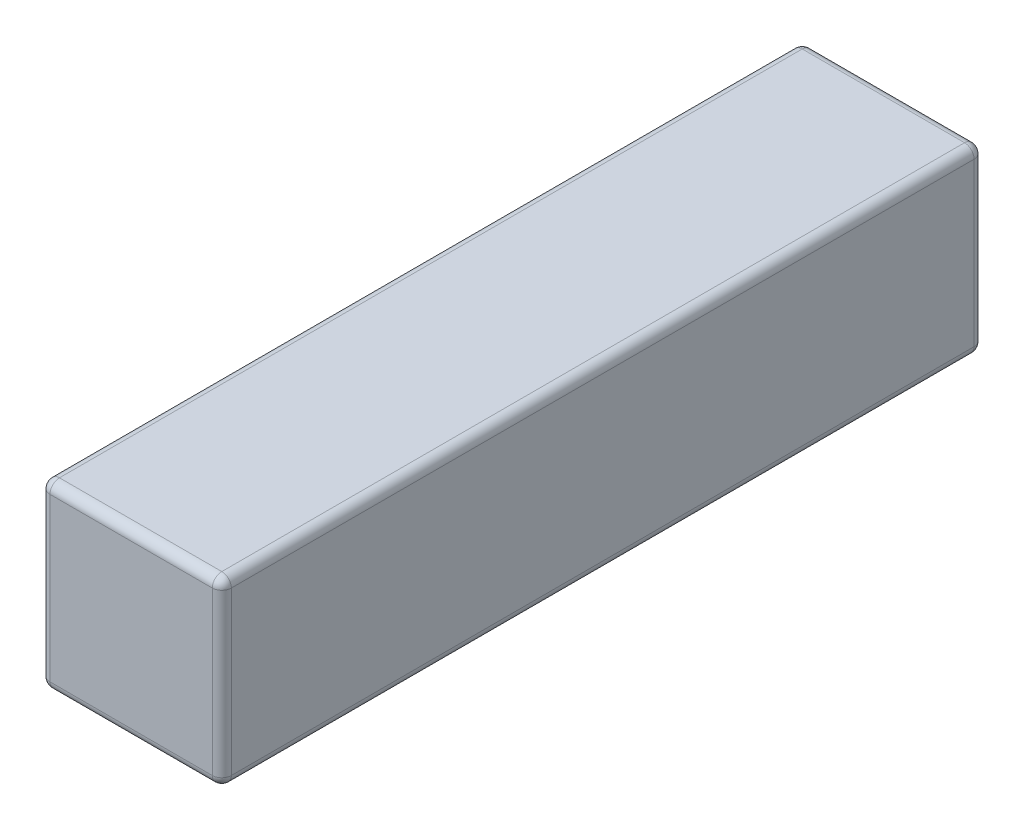
ISO-10303-21;
HEADER;
FILE_DESCRIPTION(('STEP AP214'),'2;1');
FILE_NAME('part.step','',(''),(''),'','','');
FILE_SCHEMA(('AUTOMOTIVE_DESIGN { 1 0 10303 214 1 1 1 1 }'));
ENDSEC;
DATA;
#1=APPLICATION_CONTEXT('core data for automotive mechanical design processes');
#2=APPLICATION_PROTOCOL_DEFINITION('international standard','automotive_design',2000,#1);
#3=PRODUCT_CONTEXT('',#1,'mechanical');
#4=PRODUCT('Part','Part','',(#3));
#5=PRODUCT_RELATED_PRODUCT_CATEGORY('part','',(#4));
#6=PRODUCT_DEFINITION_FORMATION('','',#4);
#7=PRODUCT_DEFINITION_CONTEXT('part definition',#1,'design');
#8=PRODUCT_DEFINITION('design','',#6,#7);
#9=PRODUCT_DEFINITION_SHAPE('','',#8);
#10=(LENGTH_UNIT() NAMED_UNIT(*) SI_UNIT(.MILLI.,.METRE.));
#11=(NAMED_UNIT(*) PLANE_ANGLE_UNIT() SI_UNIT($,.RADIAN.));
#12=(NAMED_UNIT(*) SI_UNIT($,.STERADIAN.) SOLID_ANGLE_UNIT());
#13=UNCERTAINTY_MEASURE_WITH_UNIT(LENGTH_MEASURE(1.E-05),#10,'distance_accuracy_value','');
#14=(GEOMETRIC_REPRESENTATION_CONTEXT(3) GLOBAL_UNCERTAINTY_ASSIGNED_CONTEXT((#13)) GLOBAL_UNIT_ASSIGNED_CONTEXT((#10,
#11,#12)) REPRESENTATION_CONTEXT('',''));
#15=CARTESIAN_POINT('',(0.,0.,0.));
#16=DIRECTION('',(0.,0.,1.));
#17=DIRECTION('',(1.,0.,0.));
#18=AXIS2_PLACEMENT_3D('',#15,#16,#17);
#19=CARTESIAN_POINT('',(-4.7625,-4.7625,40.));
#20=DIRECTION('',(-1.,0.,0.));
#21=DIRECTION('',(0.,0.,1.));
#22=AXIS2_PLACEMENT_3D('',#19,#20,#21);
#23=PLANE('',#22);
#24=DIRECTION('',(0.,0.,-1.));
#25=VECTOR('',#24,1.);
#26=CARTESIAN_POINT('',(-4.7625,-4.2625,40.));
#27=LINE('',#26,#25);
#28=CARTESIAN_POINT('',(-4.7625,-4.2625,0.5));
#29=VERTEX_POINT('',#28);
#30=CARTESIAN_POINT('',(-4.7625,-4.2625,39.5));
#31=VERTEX_POINT('',#30);
#32=EDGE_CURVE('E242',#29,#31,#27,.F.);
#33=ORIENTED_EDGE('',*,*,#32,.T.);
#34=DIRECTION('',(0.,1.,0.));
#35=VECTOR('',#34,1.);
#36=CARTESIAN_POINT('',(-4.7625,4.7625,39.5));
#37=LINE('',#36,#35);
#38=CARTESIAN_POINT('',(-4.7625,4.2625,39.5));
#39=VERTEX_POINT('',#38);
#40=EDGE_CURVE('E247',#31,#39,#37,.T.);
#41=ORIENTED_EDGE('',*,*,#40,.T.);
#42=DIRECTION('',(0.,0.,-1.));
#43=VECTOR('',#42,1.);
#44=CARTESIAN_POINT('',(-4.7625,4.2625,40.));
#45=LINE('',#44,#43);
#46=CARTESIAN_POINT('',(-4.7625,4.2625,0.5));
#47=VERTEX_POINT('',#46);
#48=EDGE_CURVE('E243',#39,#47,#45,.T.);
#49=ORIENTED_EDGE('',*,*,#48,.T.);
#50=DIRECTION('',(0.,1.,0.));
#51=VECTOR('',#50,1.);
#52=CARTESIAN_POINT('',(-4.7625,-4.7625,0.5));
#53=LINE('',#52,#51);
#54=EDGE_CURVE('E238',#47,#29,#53,.F.);
#55=ORIENTED_EDGE('',*,*,#54,.T.);
#56=EDGE_LOOP('',(#33,#41,#49,#55));
#57=FACE_BOUND('',#56,.T.);
#58=ADVANCED_FACE('F38',(#57),#23,.T.);
#59=CARTESIAN_POINT('',(-4.7625,-4.7625,40.));
#60=DIRECTION('',(0.,1.,0.));
#61=DIRECTION('',(0.,0.,1.));
#62=AXIS2_PLACEMENT_3D('',#59,#60,#61);
#63=PLANE('',#62);
#64=DIRECTION('',(1.,0.,0.));
#65=VECTOR('',#64,1.);
#66=CARTESIAN_POINT('',(4.7625,-4.7625,0.5));
#67=LINE('',#66,#65);
#68=CARTESIAN_POINT('',(-4.2625,-4.7625,0.5));
#69=VERTEX_POINT('',#68);
#70=CARTESIAN_POINT('',(4.2625,-4.7625,0.5));
#71=VERTEX_POINT('',#70);
#72=EDGE_CURVE('E296',#69,#71,#67,.T.);
#73=ORIENTED_EDGE('',*,*,#72,.T.);
#74=DIRECTION('',(0.,0.,-1.));
#75=VECTOR('',#74,1.);
#76=CARTESIAN_POINT('',(4.2625,-4.7625,40.));
#77=LINE('',#76,#75);
#78=CARTESIAN_POINT('',(4.2625,-4.7625,39.5));
#79=VERTEX_POINT('',#78);
#80=EDGE_CURVE('E302',#71,#79,#77,.F.);
#81=ORIENTED_EDGE('',*,*,#80,.T.);
#82=DIRECTION('',(1.,0.,0.));
#83=VECTOR('',#82,1.);
#84=CARTESIAN_POINT('',(-4.7625,-4.7625,39.5));
#85=LINE('',#84,#83);
#86=CARTESIAN_POINT('',(-4.2625,-4.7625,39.5));
#87=VERTEX_POINT('',#86);
#88=EDGE_CURVE('E299',#79,#87,#85,.F.);
#89=ORIENTED_EDGE('',*,*,#88,.T.);
#90=DIRECTION('',(0.,0.,-1.));
#91=VECTOR('',#90,1.);
#92=CARTESIAN_POINT('',(-4.2625,-4.7625,0.));
#93=LINE('',#92,#91);
#94=EDGE_CURVE('E290',#87,#69,#93,.T.);
#95=ORIENTED_EDGE('',*,*,#94,.T.);
#96=EDGE_LOOP('',(#73,#81,#89,#95));
#97=FACE_BOUND('',#96,.T.);
#98=ADVANCED_FACE('F300',(#97),#63,.F.);
#99=CARTESIAN_POINT('',(4.7625,-4.7625,40.));
#100=DIRECTION('',(-1.,0.,0.));
#101=DIRECTION('',(0.,0.,1.));
#102=AXIS2_PLACEMENT_3D('',#99,#100,#101);
#103=PLANE('',#102);
#104=DIRECTION('',(0.,1.,0.));
#105=VECTOR('',#104,1.);
#106=CARTESIAN_POINT('',(4.7625,-4.7625,39.5));
#107=LINE('',#106,#105);
#108=CARTESIAN_POINT('',(4.7625,4.2625,39.5));
#109=VERTEX_POINT('',#108);
#110=CARTESIAN_POINT('',(4.7625,-4.2625,39.5));
#111=VERTEX_POINT('',#110);
#112=EDGE_CURVE('E161',#109,#111,#107,.F.);
#113=ORIENTED_EDGE('',*,*,#112,.T.);
#114=DIRECTION('',(0.,0.,-1.));
#115=VECTOR('',#114,1.);
#116=CARTESIAN_POINT('',(4.7625,-4.2625,40.));
#117=LINE('',#116,#115);
#118=CARTESIAN_POINT('',(4.7625,-4.2625,0.5));
#119=VERTEX_POINT('',#118);
#120=EDGE_CURVE('E249',#111,#119,#117,.T.);
#121=ORIENTED_EDGE('',*,*,#120,.T.);
#122=DIRECTION('',(0.,1.,0.));
#123=VECTOR('',#122,1.);
#124=CARTESIAN_POINT('',(4.7625,4.7625,0.5));
#125=LINE('',#124,#123);
#126=CARTESIAN_POINT('',(4.7625,4.2625,0.5));
#127=VERTEX_POINT('',#126);
#128=EDGE_CURVE('E327',#119,#127,#125,.T.);
#129=ORIENTED_EDGE('',*,*,#128,.T.);
#130=DIRECTION('',(0.,0.,-1.));
#131=VECTOR('',#130,1.);
#132=CARTESIAN_POINT('',(4.7625,4.2625,40.));
#133=LINE('',#132,#131);
#134=EDGE_CURVE('E324',#127,#109,#133,.F.);
#135=ORIENTED_EDGE('',*,*,#134,.T.);
#136=EDGE_LOOP('',(#113,#121,#129,#135));
#137=FACE_BOUND('',#136,.T.);
#138=ADVANCED_FACE('F335',(#137),#103,.F.);
#139=CARTESIAN_POINT('',(-4.7625,4.7625,40.));
#140=DIRECTION('',(0.,1.,0.));
#141=DIRECTION('',(0.,0.,1.));
#142=AXIS2_PLACEMENT_3D('',#139,#140,#141);
#143=PLANE('',#142);
#144=DIRECTION('',(1.,0.,0.));
#145=VECTOR('',#144,1.);
#146=CARTESIAN_POINT('',(4.7625,4.7625,39.5));
#147=LINE('',#146,#145);
#148=CARTESIAN_POINT('',(-4.2625,4.7625,39.5));
#149=VERTEX_POINT('',#148);
#150=CARTESIAN_POINT('',(4.2625,4.7625,39.5));
#151=VERTEX_POINT('',#150);
#152=EDGE_CURVE('E48',#149,#151,#147,.T.);
#153=ORIENTED_EDGE('',*,*,#152,.T.);
#154=DIRECTION('',(0.,0.,-1.));
#155=VECTOR('',#154,1.);
#156=CARTESIAN_POINT('',(4.2625,4.7625,0.));
#157=LINE('',#156,#155);
#158=CARTESIAN_POINT('',(4.2625,4.7625,0.5));
#159=VERTEX_POINT('',#158);
#160=EDGE_CURVE('E11',#151,#159,#157,.T.);
#161=ORIENTED_EDGE('',*,*,#160,.T.);
#162=DIRECTION('',(1.,0.,0.));
#163=VECTOR('',#162,1.);
#164=CARTESIAN_POINT('',(-4.7625,4.7625,0.5));
#165=LINE('',#164,#163);
#166=CARTESIAN_POINT('',(-4.2625,4.7625,0.5));
#167=VERTEX_POINT('',#166);
#168=EDGE_CURVE('E256',#159,#167,#165,.F.);
#169=ORIENTED_EDGE('',*,*,#168,.T.);
#170=DIRECTION('',(0.,0.,-1.));
#171=VECTOR('',#170,1.);
#172=CARTESIAN_POINT('',(-4.2625,4.7625,40.));
#173=LINE('',#172,#171);
#174=EDGE_CURVE('E59',#167,#149,#173,.F.);
#175=ORIENTED_EDGE('',*,*,#174,.T.);
#176=EDGE_LOOP('',(#153,#161,#169,#175));
#177=FACE_BOUND('',#176,.T.);
#178=ADVANCED_FACE('F377',(#177),#143,.T.);
#179=CARTESIAN_POINT('',(0.,0.,40.));
#180=DIRECTION('',(0.,0.,-1.));
#181=DIRECTION('',(-1.,0.,0.));
#182=AXIS2_PLACEMENT_3D('',#179,#180,#181);
#183=PLANE('',#182);
#184=DIRECTION('',(0.,1.,0.));
#185=VECTOR('',#184,1.);
#186=CARTESIAN_POINT('',(-4.2625,-4.7625,40.));
#187=LINE('',#186,#185);
#188=CARTESIAN_POINT('',(-4.2625,4.2625,40.));
#189=VERTEX_POINT('',#188);
#190=CARTESIAN_POINT('',(-4.2625,-4.2625,40.));
#191=VERTEX_POINT('',#190);
#192=EDGE_CURVE('E138',#189,#191,#187,.F.);
#193=ORIENTED_EDGE('',*,*,#192,.T.);
#194=DIRECTION('',(1.,0.,0.));
#195=VECTOR('',#194,1.);
#196=CARTESIAN_POINT('',(0.,-4.2625,40.));
#197=LINE('',#196,#195);
#198=CARTESIAN_POINT('',(4.2625,-4.2625,40.));
#199=VERTEX_POINT('',#198);
#200=EDGE_CURVE('E133',#191,#199,#197,.T.);
#201=ORIENTED_EDGE('',*,*,#200,.T.);
#202=DIRECTION('',(0.,1.,0.));
#203=VECTOR('',#202,1.);
#204=CARTESIAN_POINT('',(4.2625,0.,40.));
#205=LINE('',#204,#203);
#206=CARTESIAN_POINT('',(4.2625,4.2625,40.));
#207=VERTEX_POINT('',#206);
#208=EDGE_CURVE('E127',#199,#207,#205,.T.);
#209=ORIENTED_EDGE('',*,*,#208,.T.);
#210=DIRECTION('',(1.,0.,0.));
#211=VECTOR('',#210,1.);
#212=CARTESIAN_POINT('',(-4.7625,4.2625,40.));
#213=LINE('',#212,#211);
#214=EDGE_CURVE('E130',#207,#189,#213,.F.);
#215=ORIENTED_EDGE('',*,*,#214,.T.);
#216=EDGE_LOOP('',(#193,#201,#209,#215));
#217=FACE_BOUND('',#216,.T.);
#218=ADVANCED_FACE('F129',(#217),#183,.F.);
#219=CARTESIAN_POINT('',(0.,0.,0.));
#220=DIRECTION('',(0.,0.,-1.));
#221=DIRECTION('',(-1.,0.,0.));
#222=AXIS2_PLACEMENT_3D('',#219,#220,#221);
#223=PLANE('',#222);
#224=DIRECTION('',(0.,1.,0.));
#225=VECTOR('',#224,1.);
#226=CARTESIAN_POINT('',(4.2625,-4.7625,0.));
#227=LINE('',#226,#225);
#228=CARTESIAN_POINT('',(4.2625,4.2625,0.));
#229=VERTEX_POINT('',#228);
#230=CARTESIAN_POINT('',(4.2625,-4.2625,0.));
#231=VERTEX_POINT('',#230);
#232=EDGE_CURVE('E318',#229,#231,#227,.F.);
#233=ORIENTED_EDGE('',*,*,#232,.T.);
#234=DIRECTION('',(1.,0.,0.));
#235=VECTOR('',#234,1.);
#236=CARTESIAN_POINT('',(-4.7625,-4.2625,0.));
#237=LINE('',#236,#235);
#238=CARTESIAN_POINT('',(-4.2625,-4.2625,0.));
#239=VERTEX_POINT('',#238);
#240=EDGE_CURVE('E321',#231,#239,#237,.F.);
#241=ORIENTED_EDGE('',*,*,#240,.T.);
#242=DIRECTION('',(0.,1.,0.));
#243=VECTOR('',#242,1.);
#244=CARTESIAN_POINT('',(-4.2625,0.,0.));
#245=LINE('',#244,#243);
#246=CARTESIAN_POINT('',(-4.2625,4.2625,0.));
#247=VERTEX_POINT('',#246);
#248=EDGE_CURVE('E236',#239,#247,#245,.T.);
#249=ORIENTED_EDGE('',*,*,#248,.T.);
#250=DIRECTION('',(1.,0.,0.));
#251=VECTOR('',#250,1.);
#252=CARTESIAN_POINT('',(0.,4.2625,0.));
#253=LINE('',#252,#251);
#254=EDGE_CURVE('E310',#247,#229,#253,.T.);
#255=ORIENTED_EDGE('',*,*,#254,.T.);
#256=EDGE_LOOP('',(#233,#241,#249,#255));
#257=FACE_BOUND('',#256,.T.);
#258=ADVANCED_FACE('F410',(#257),#223,.T.);
#259=CARTESIAN_POINT('',(0.,4.2625,0.5));
#260=DIRECTION('',(1.,0.,0.));
#261=DIRECTION('',(0.,0.,-1.));
#262=AXIS2_PLACEMENT_3D('',#259,#260,#261);
#263=CYLINDRICAL_SURFACE('',#262,0.5);
#264=CARTESIAN_POINT('',(-4.2625,4.2625,0.5));
#265=DIRECTION('',(-1.,0.,0.));
#266=DIRECTION('',(0.,0.,1.));
#267=AXIS2_PLACEMENT_3D('',#264,#265,#266);
#268=CIRCLE('',#267,0.5);
#269=EDGE_CURVE('E42',#167,#247,#268,.T.);
#270=ORIENTED_EDGE('',*,*,#269,.F.);
#271=ORIENTED_EDGE('',*,*,#168,.F.);
#272=CARTESIAN_POINT('',(4.2625,4.2625,0.5));
#273=DIRECTION('',(1.,0.,0.));
#274=DIRECTION('',(0.,0.,-1.));
#275=AXIS2_PLACEMENT_3D('',#272,#273,#274);
#276=CIRCLE('',#275,0.5);
#277=EDGE_CURVE('E214',#229,#159,#276,.T.);
#278=ORIENTED_EDGE('',*,*,#277,.F.);
#279=ORIENTED_EDGE('',*,*,#254,.F.);
#280=EDGE_LOOP('',(#270,#271,#278,#279));
#281=FACE_BOUND('',#280,.T.);
#282=ADVANCED_FACE('F40',(#281),#263,.T.);
#283=CARTESIAN_POINT('',(-4.2625,4.2625,0.5));
#284=DIRECTION('',(0.,0.,-1.));
#285=DIRECTION('',(-1.,0.,0.));
#286=AXIS2_PLACEMENT_3D('',#283,#284,#285);
#287=SPHERICAL_SURFACE('',#286,0.5);
#288=CARTESIAN_POINT('',(-4.2625,4.2625,0.5));
#289=DIRECTION('',(0.,0.,-1.));
#290=DIRECTION('',(-1.,0.,0.));
#291=AXIS2_PLACEMENT_3D('',#288,#289,#290);
#292=CIRCLE('',#291,0.5);
#293=EDGE_CURVE('E207',#167,#47,#292,.F.);
#294=ORIENTED_EDGE('',*,*,#293,.F.);
#295=ORIENTED_EDGE('',*,*,#269,.T.);
#296=CARTESIAN_POINT('',(-4.2625,4.2625,0.5));
#297=DIRECTION('',(0.,1.,0.));
#298=DIRECTION('',(0.,0.,1.));
#299=AXIS2_PLACEMENT_3D('',#296,#297,#298);
#300=CIRCLE('',#299,0.5);
#301=EDGE_CURVE('E211',#47,#247,#300,.F.);
#302=ORIENTED_EDGE('',*,*,#301,.F.);
#303=EDGE_LOOP('',(#294,#295,#302));
#304=FACE_BOUND('',#303,.T.);
#305=ADVANCED_FACE('F228',(#304),#287,.T.);
#306=CARTESIAN_POINT('',(4.2625,4.2625,0.5));
#307=DIRECTION('',(0.,1.,0.));
#308=DIRECTION('',(0.,0.,1.));
#309=AXIS2_PLACEMENT_3D('',#306,#307,#308);
#310=SPHERICAL_SURFACE('',#309,0.5);
#311=CARTESIAN_POINT('',(4.2625,4.2625,0.5));
#312=DIRECTION('',(0.,1.,0.));
#313=DIRECTION('',(0.,0.,1.));
#314=AXIS2_PLACEMENT_3D('',#311,#312,#313);
#315=CIRCLE('',#314,0.5);
#316=EDGE_CURVE('E200',#229,#127,#315,.F.);
#317=ORIENTED_EDGE('',*,*,#316,.F.);
#318=ORIENTED_EDGE('',*,*,#277,.T.);
#319=CARTESIAN_POINT('',(4.2625,4.2625,0.5));
#320=DIRECTION('',(0.,0.,-1.));
#321=DIRECTION('',(-1.,0.,0.));
#322=AXIS2_PLACEMENT_3D('',#319,#320,#321);
#323=CIRCLE('',#322,0.5);
#324=EDGE_CURVE('E204',#127,#159,#323,.F.);
#325=ORIENTED_EDGE('',*,*,#324,.F.);
#326=EDGE_LOOP('',(#317,#318,#325));
#327=FACE_BOUND('',#326,.T.);
#328=ADVANCED_FACE('F407',(#327),#310,.T.);
#329=CARTESIAN_POINT('',(-4.2625,0.,0.5));
#330=DIRECTION('',(0.,1.,0.));
#331=DIRECTION('',(0.,0.,1.));
#332=AXIS2_PLACEMENT_3D('',#329,#330,#331);
#333=CYLINDRICAL_SURFACE('',#332,0.5);
#334=ORIENTED_EDGE('',*,*,#301,.T.);
#335=ORIENTED_EDGE('',*,*,#248,.F.);
#336=CARTESIAN_POINT('',(-4.2625,-4.2625,0.5));
#337=DIRECTION('',(0.,-1.,0.));
#338=DIRECTION('',(0.,0.,-1.));
#339=AXIS2_PLACEMENT_3D('',#336,#337,#338);
#340=CIRCLE('',#339,0.5);
#341=EDGE_CURVE('E193',#29,#239,#340,.T.);
#342=ORIENTED_EDGE('',*,*,#341,.F.);
#343=ORIENTED_EDGE('',*,*,#54,.F.);
#344=EDGE_LOOP('',(#334,#335,#342,#343));
#345=FACE_BOUND('',#344,.T.);
#346=ADVANCED_FACE('F234',(#345),#333,.T.);
#347=CARTESIAN_POINT('',(-4.2625,4.2625,40.));
#348=DIRECTION('',(0.,0.,-1.));
#349=DIRECTION('',(-1.,0.,0.));
#350=AXIS2_PLACEMENT_3D('',#347,#348,#349);
#351=CYLINDRICAL_SURFACE('',#350,0.5);
#352=ORIENTED_EDGE('',*,*,#293,.T.);
#353=ORIENTED_EDGE('',*,*,#48,.F.);
#354=CARTESIAN_POINT('',(-4.2625,4.2625,39.5));
#355=DIRECTION('',(0.,0.,1.));
#356=DIRECTION('',(1.,0.,0.));
#357=AXIS2_PLACEMENT_3D('',#354,#355,#356);
#358=CIRCLE('',#357,0.5);
#359=EDGE_CURVE('E189',#149,#39,#358,.T.);
#360=ORIENTED_EDGE('',*,*,#359,.F.);
#361=ORIENTED_EDGE('',*,*,#174,.F.);
#362=EDGE_LOOP('',(#352,#353,#360,#361));
#363=FACE_BOUND('',#362,.T.);
#364=ADVANCED_FACE('F354',(#363),#351,.T.);
#365=CARTESIAN_POINT('',(-4.7625,4.2625,39.5));
#366=DIRECTION('',(-1.,0.,0.));
#367=DIRECTION('',(0.,0.,1.));
#368=AXIS2_PLACEMENT_3D('',#365,#366,#367);
#369=CYLINDRICAL_SURFACE('',#368,0.5);
#370=CARTESIAN_POINT('',(4.2625,4.2625,39.5));
#371=DIRECTION('',(1.,0.,0.));
#372=DIRECTION('',(0.,0.,-1.));
#373=AXIS2_PLACEMENT_3D('',#370,#371,#372);
#374=CIRCLE('',#373,0.5);
#375=EDGE_CURVE('E144',#151,#207,#374,.T.);
#376=ORIENTED_EDGE('',*,*,#375,.F.);
#377=ORIENTED_EDGE('',*,*,#152,.F.);
#378=CARTESIAN_POINT('',(-4.2625,4.2625,39.5));
#379=DIRECTION('',(-1.,0.,0.));
#380=DIRECTION('',(0.,0.,1.));
#381=AXIS2_PLACEMENT_3D('',#378,#379,#380);
#382=CIRCLE('',#381,0.5);
#383=EDGE_CURVE('E147',#189,#149,#382,.T.);
#384=ORIENTED_EDGE('',*,*,#383,.F.);
#385=ORIENTED_EDGE('',*,*,#214,.F.);
#386=EDGE_LOOP('',(#376,#377,#384,#385));
#387=FACE_BOUND('',#386,.T.);
#388=ADVANCED_FACE('F143',(#387),#369,.T.);
#389=CARTESIAN_POINT('',(4.2625,4.2625,40.));
#390=DIRECTION('',(0.,0.,1.));
#391=DIRECTION('',(1.,0.,0.));
#392=AXIS2_PLACEMENT_3D('',#389,#390,#391);
#393=CYLINDRICAL_SURFACE('',#392,0.5);
#394=ORIENTED_EDGE('',*,*,#324,.T.);
#395=ORIENTED_EDGE('',*,*,#160,.F.);
#396=CARTESIAN_POINT('',(4.2625,4.2625,39.5));
#397=DIRECTION('',(0.,0.,1.));
#398=DIRECTION('',(1.,0.,0.));
#399=AXIS2_PLACEMENT_3D('',#396,#397,#398);
#400=CIRCLE('',#399,0.5);
#401=EDGE_CURVE('E157',#109,#151,#400,.T.);
#402=ORIENTED_EDGE('',*,*,#401,.F.);
#403=ORIENTED_EDGE('',*,*,#134,.F.);
#404=EDGE_LOOP('',(#394,#395,#402,#403));
#405=FACE_BOUND('',#404,.T.);
#406=ADVANCED_FACE('F409',(#405),#393,.T.);
#407=CARTESIAN_POINT('',(4.2625,-4.7625,0.5));
#408=DIRECTION('',(0.,-1.,0.));
#409=DIRECTION('',(0.,0.,-1.));
#410=AXIS2_PLACEMENT_3D('',#407,#408,#409);
#411=CYLINDRICAL_SURFACE('',#410,0.5);
#412=ORIENTED_EDGE('',*,*,#316,.T.);
#413=ORIENTED_EDGE('',*,*,#128,.F.);
#414=CARTESIAN_POINT('',(4.2625,-4.2625,0.5));
#415=DIRECTION('',(0.,-1.,0.));
#416=DIRECTION('',(0.,0.,-1.));
#417=AXIS2_PLACEMENT_3D('',#414,#415,#416);
#418=CIRCLE('',#417,0.5);
#419=EDGE_CURVE('E181',#231,#119,#418,.T.);
#420=ORIENTED_EDGE('',*,*,#419,.F.);
#421=ORIENTED_EDGE('',*,*,#232,.F.);
#422=EDGE_LOOP('',(#412,#413,#420,#421));
#423=FACE_BOUND('',#422,.T.);
#424=ADVANCED_FACE('F405',(#423),#411,.T.);
#425=CARTESIAN_POINT('',(-4.7625,-4.2625,0.5));
#426=DIRECTION('',(-1.,0.,0.));
#427=DIRECTION('',(0.,0.,1.));
#428=AXIS2_PLACEMENT_3D('',#425,#426,#427);
#429=CYLINDRICAL_SURFACE('',#428,0.5);
#430=CARTESIAN_POINT('',(-4.2625,-4.2625,0.5));
#431=DIRECTION('',(-1.,0.,0.));
#432=DIRECTION('',(0.,0.,1.));
#433=AXIS2_PLACEMENT_3D('',#430,#431,#432);
#434=CIRCLE('',#433,0.5);
#435=EDGE_CURVE('E196',#239,#69,#434,.T.);
#436=ORIENTED_EDGE('',*,*,#435,.F.);
#437=ORIENTED_EDGE('',*,*,#240,.F.);
#438=CARTESIAN_POINT('',(4.2625,-4.2625,0.5));
#439=DIRECTION('',(1.,0.,0.));
#440=DIRECTION('',(0.,0.,-1.));
#441=AXIS2_PLACEMENT_3D('',#438,#439,#440);
#442=CIRCLE('',#441,0.5);
#443=EDGE_CURVE('E177',#71,#231,#442,.T.);
#444=ORIENTED_EDGE('',*,*,#443,.F.);
#445=ORIENTED_EDGE('',*,*,#72,.F.);
#446=EDGE_LOOP('',(#436,#437,#444,#445));
#447=FACE_BOUND('',#446,.T.);
#448=ADVANCED_FACE('F366',(#447),#429,.T.);
#449=CARTESIAN_POINT('',(-4.2625,-4.2625,0.5));
#450=DIRECTION('',(0.,0.,-1.));
#451=DIRECTION('',(-1.,0.,0.));
#452=AXIS2_PLACEMENT_3D('',#449,#450,#451);
#453=SPHERICAL_SURFACE('',#452,0.5);
#454=ORIENTED_EDGE('',*,*,#341,.T.);
#455=ORIENTED_EDGE('',*,*,#435,.T.);
#456=CARTESIAN_POINT('',(-4.2625,-4.2625,0.5));
#457=DIRECTION('',(0.,0.,-1.));
#458=DIRECTION('',(-1.,0.,0.));
#459=AXIS2_PLACEMENT_3D('',#456,#457,#458);
#460=CIRCLE('',#459,0.5);
#461=EDGE_CURVE('E168',#29,#69,#460,.F.);
#462=ORIENTED_EDGE('',*,*,#461,.F.);
#463=EDGE_LOOP('',(#454,#455,#462));
#464=FACE_BOUND('',#463,.T.);
#465=ADVANCED_FACE('F358',(#464),#453,.T.);
#466=CARTESIAN_POINT('',(-4.2625,4.2625,39.5));
#467=DIRECTION('',(0.,1.,0.));
#468=DIRECTION('',(0.,0.,1.));
#469=AXIS2_PLACEMENT_3D('',#466,#467,#468);
#470=SPHERICAL_SURFACE('',#469,0.5);
#471=ORIENTED_EDGE('',*,*,#383,.T.);
#472=ORIENTED_EDGE('',*,*,#359,.T.);
#473=CARTESIAN_POINT('',(-4.2625,4.2625,39.5));
#474=DIRECTION('',(0.,1.,0.));
#475=DIRECTION('',(0.,0.,1.));
#476=AXIS2_PLACEMENT_3D('',#473,#474,#475);
#477=CIRCLE('',#476,0.5);
#478=EDGE_CURVE('E163',#189,#39,#477,.F.);
#479=ORIENTED_EDGE('',*,*,#478,.F.);
#480=EDGE_LOOP('',(#471,#472,#479));
#481=FACE_BOUND('',#480,.T.);
#482=ADVANCED_FACE('F356',(#481),#470,.T.);
#483=CARTESIAN_POINT('',(4.2625,4.2625,39.5));
#484=DIRECTION('',(0.,1.,0.));
#485=DIRECTION('',(0.,0.,1.));
#486=AXIS2_PLACEMENT_3D('',#483,#484,#485);
#487=SPHERICAL_SURFACE('',#486,0.5);
#488=ORIENTED_EDGE('',*,*,#401,.T.);
#489=ORIENTED_EDGE('',*,*,#375,.T.);
#490=CARTESIAN_POINT('',(4.2625,4.2625,39.5));
#491=DIRECTION('',(0.,1.,0.));
#492=DIRECTION('',(0.,0.,1.));
#493=AXIS2_PLACEMENT_3D('',#490,#491,#492);
#494=CIRCLE('',#493,0.5);
#495=EDGE_CURVE('E154',#109,#207,#494,.F.);
#496=ORIENTED_EDGE('',*,*,#495,.F.);
#497=EDGE_LOOP('',(#488,#489,#496));
#498=FACE_BOUND('',#497,.T.);
#499=ADVANCED_FACE('F153',(#498),#487,.T.);
#500=CARTESIAN_POINT('',(4.2625,-4.2625,0.5));
#501=DIRECTION('',(0.,0.,-1.));
#502=DIRECTION('',(-1.,0.,0.));
#503=AXIS2_PLACEMENT_3D('',#500,#501,#502);
#504=SPHERICAL_SURFACE('',#503,0.5);
#505=ORIENTED_EDGE('',*,*,#443,.T.);
#506=ORIENTED_EDGE('',*,*,#419,.T.);
#507=CARTESIAN_POINT('',(4.2625,-4.2625,0.5));
#508=DIRECTION('',(0.,0.,-1.));
#509=DIRECTION('',(-1.,0.,0.));
#510=AXIS2_PLACEMENT_3D('',#507,#508,#509);
#511=CIRCLE('',#510,0.5);
#512=EDGE_CURVE('E164',#71,#119,#511,.F.);
#513=ORIENTED_EDGE('',*,*,#512,.F.);
#514=EDGE_LOOP('',(#505,#506,#513));
#515=FACE_BOUND('',#514,.T.);
#516=ADVANCED_FACE('F364',(#515),#504,.T.);
#517=CARTESIAN_POINT('',(-4.2625,-4.2625,40.));
#518=DIRECTION('',(0.,0.,1.));
#519=DIRECTION('',(1.,0.,0.));
#520=AXIS2_PLACEMENT_3D('',#517,#518,#519);
#521=CYLINDRICAL_SURFACE('',#520,0.5);
#522=ORIENTED_EDGE('',*,*,#461,.T.);
#523=ORIENTED_EDGE('',*,*,#94,.F.);
#524=CARTESIAN_POINT('',(-4.2625,-4.2625,39.5));
#525=DIRECTION('',(0.,0.,1.));
#526=DIRECTION('',(1.,0.,0.));
#527=AXIS2_PLACEMENT_3D('',#524,#525,#526);
#528=CIRCLE('',#527,0.5);
#529=EDGE_CURVE('E170',#31,#87,#528,.T.);
#530=ORIENTED_EDGE('',*,*,#529,.F.);
#531=ORIENTED_EDGE('',*,*,#32,.F.);
#532=EDGE_LOOP('',(#522,#523,#530,#531));
#533=FACE_BOUND('',#532,.T.);
#534=ADVANCED_FACE('F292',(#533),#521,.T.);
#535=CARTESIAN_POINT('',(-4.2625,-4.7625,39.5));
#536=DIRECTION('',(0.,-1.,0.));
#537=DIRECTION('',(0.,0.,-1.));
#538=AXIS2_PLACEMENT_3D('',#535,#536,#537);
#539=CYLINDRICAL_SURFACE('',#538,0.5);
#540=ORIENTED_EDGE('',*,*,#478,.T.);
#541=ORIENTED_EDGE('',*,*,#40,.F.);
#542=CARTESIAN_POINT('',(-4.2625,-4.2625,39.5));
#543=DIRECTION('',(0.,-1.,0.));
#544=DIRECTION('',(0.,0.,-1.));
#545=AXIS2_PLACEMENT_3D('',#542,#543,#544);
#546=CIRCLE('',#545,0.5);
#547=EDGE_CURVE('E277',#191,#31,#546,.T.);
#548=ORIENTED_EDGE('',*,*,#547,.F.);
#549=ORIENTED_EDGE('',*,*,#192,.F.);
#550=EDGE_LOOP('',(#540,#541,#548,#549));
#551=FACE_BOUND('',#550,.T.);
#552=ADVANCED_FACE('F350',(#551),#539,.T.);
#553=CARTESIAN_POINT('',(4.2625,0.,39.5));
#554=DIRECTION('',(0.,1.,0.));
#555=DIRECTION('',(0.,0.,1.));
#556=AXIS2_PLACEMENT_3D('',#553,#554,#555);
#557=CYLINDRICAL_SURFACE('',#556,0.5);
#558=ORIENTED_EDGE('',*,*,#495,.T.);
#559=ORIENTED_EDGE('',*,*,#208,.F.);
#560=CARTESIAN_POINT('',(4.2625,-4.2625,39.5));
#561=DIRECTION('',(0.,-1.,0.));
#562=DIRECTION('',(0.,0.,-1.));
#563=AXIS2_PLACEMENT_3D('',#560,#561,#562);
#564=CIRCLE('',#563,0.5);
#565=EDGE_CURVE('E273',#111,#199,#564,.T.);
#566=ORIENTED_EDGE('',*,*,#565,.F.);
#567=ORIENTED_EDGE('',*,*,#112,.F.);
#568=EDGE_LOOP('',(#558,#559,#566,#567));
#569=FACE_BOUND('',#568,.T.);
#570=ADVANCED_FACE('F160',(#569),#557,.T.);
#571=CARTESIAN_POINT('',(4.2625,-4.2625,40.));
#572=DIRECTION('',(0.,0.,-1.));
#573=DIRECTION('',(-1.,0.,0.));
#574=AXIS2_PLACEMENT_3D('',#571,#572,#573);
#575=CYLINDRICAL_SURFACE('',#574,0.5);
#576=ORIENTED_EDGE('',*,*,#512,.T.);
#577=ORIENTED_EDGE('',*,*,#120,.F.);
#578=CARTESIAN_POINT('',(4.2625,-4.2625,39.5));
#579=DIRECTION('',(0.,0.,1.));
#580=DIRECTION('',(1.,0.,0.));
#581=AXIS2_PLACEMENT_3D('',#578,#579,#580);
#582=CIRCLE('',#581,0.5);
#583=EDGE_CURVE('E269',#79,#111,#582,.T.);
#584=ORIENTED_EDGE('',*,*,#583,.F.);
#585=ORIENTED_EDGE('',*,*,#80,.F.);
#586=EDGE_LOOP('',(#576,#577,#584,#585));
#587=FACE_BOUND('',#586,.T.);
#588=ADVANCED_FACE('F338',(#587),#575,.T.);
#589=CARTESIAN_POINT('',(-4.2625,-4.2625,39.5));
#590=DIRECTION('',(-1.,0.,0.));
#591=DIRECTION('',(0.,0.,1.));
#592=AXIS2_PLACEMENT_3D('',#589,#590,#591);
#593=SPHERICAL_SURFACE('',#592,0.5);
#594=ORIENTED_EDGE('',*,*,#547,.T.);
#595=ORIENTED_EDGE('',*,*,#529,.T.);
#596=CARTESIAN_POINT('',(-4.2625,-4.2625,39.5));
#597=DIRECTION('',(-1.,0.,0.));
#598=DIRECTION('',(0.,0.,1.));
#599=AXIS2_PLACEMENT_3D('',#596,#597,#598);
#600=CIRCLE('',#599,0.5);
#601=EDGE_CURVE('E266',#191,#87,#600,.F.);
#602=ORIENTED_EDGE('',*,*,#601,.F.);
#603=EDGE_LOOP('',(#594,#595,#602));
#604=FACE_BOUND('',#603,.T.);
#605=ADVANCED_FACE('F286',(#604),#593,.T.);
#606=CARTESIAN_POINT('',(4.2625,-4.2625,39.5));
#607=DIRECTION('',(1.,0.,0.));
#608=DIRECTION('',(0.,0.,-1.));
#609=AXIS2_PLACEMENT_3D('',#606,#607,#608);
#610=SPHERICAL_SURFACE('',#609,0.5);
#611=ORIENTED_EDGE('',*,*,#583,.T.);
#612=ORIENTED_EDGE('',*,*,#565,.T.);
#613=CARTESIAN_POINT('',(4.2625,-4.2625,39.5));
#614=DIRECTION('',(1.,0.,0.));
#615=DIRECTION('',(0.,0.,-1.));
#616=AXIS2_PLACEMENT_3D('',#613,#614,#615);
#617=CIRCLE('',#616,0.5);
#618=EDGE_CURVE('E263',#79,#199,#617,.F.);
#619=ORIENTED_EDGE('',*,*,#618,.F.);
#620=EDGE_LOOP('',(#611,#612,#619));
#621=FACE_BOUND('',#620,.T.);
#622=ADVANCED_FACE('F341',(#621),#610,.T.);
#623=CARTESIAN_POINT('',(0.,-4.2625,39.5));
#624=DIRECTION('',(1.,0.,0.));
#625=DIRECTION('',(0.,0.,-1.));
#626=AXIS2_PLACEMENT_3D('',#623,#624,#625);
#627=CYLINDRICAL_SURFACE('',#626,0.5);
#628=ORIENTED_EDGE('',*,*,#601,.T.);
#629=ORIENTED_EDGE('',*,*,#88,.F.);
#630=ORIENTED_EDGE('',*,*,#618,.T.);
#631=ORIENTED_EDGE('',*,*,#200,.F.);
#632=EDGE_LOOP('',(#628,#629,#630,#631));
#633=FACE_BOUND('',#632,.T.);
#634=ADVANCED_FACE('F342',(#633),#627,.T.);
#635=CLOSED_SHELL('',(#58,#98,#138,#178,#218,#258,#282,#305,#328,#346,#364,#388,#406,#424,#448,
#465,#482,#499,#516,#534,#552,#570,#588,#605,#622,#634));
#636=MANIFOLD_SOLID_BREP('B2',#635);
#637=ADVANCED_BREP_SHAPE_REPRESENTATION('',(#18,#636),#14);
#638=SHAPE_DEFINITION_REPRESENTATION(#9,#637);
ENDSEC;
END-ISO-10303-21;
